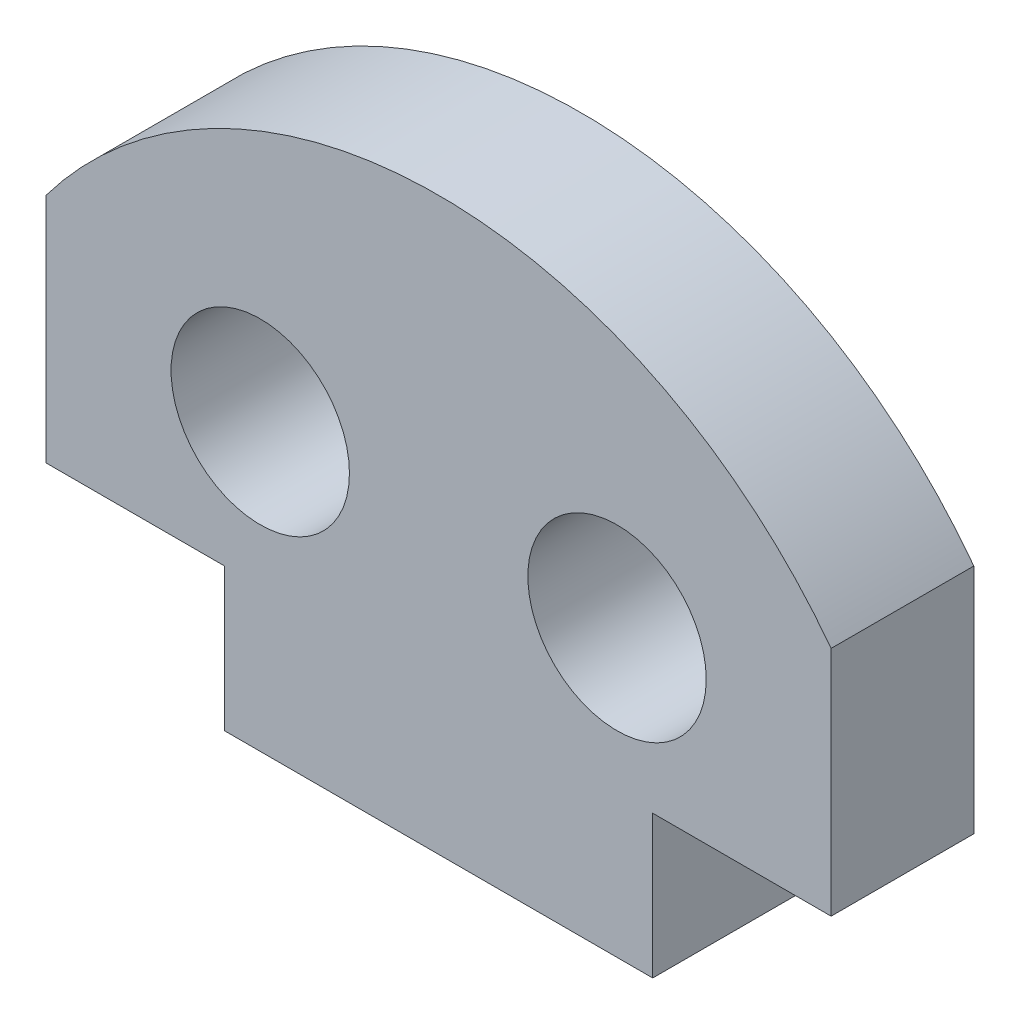
ISO-10303-21;
HEADER;
FILE_DESCRIPTION(('STEP AP214'),'2;1');
FILE_NAME('part.step','',(''),(''),'','','');
FILE_SCHEMA(('AUTOMOTIVE_DESIGN { 1 0 10303 214 1 1 1 1 }'));
ENDSEC;
DATA;
#1=APPLICATION_CONTEXT('core data for automotive mechanical design processes');
#2=APPLICATION_PROTOCOL_DEFINITION('international standard','automotive_design',2000,#1);
#3=PRODUCT_CONTEXT('',#1,'mechanical');
#4=PRODUCT('Part','Part','',(#3));
#5=PRODUCT_RELATED_PRODUCT_CATEGORY('part','',(#4));
#6=PRODUCT_DEFINITION_FORMATION('','',#4);
#7=PRODUCT_DEFINITION_CONTEXT('part definition',#1,'design');
#8=PRODUCT_DEFINITION('design','',#6,#7);
#9=PRODUCT_DEFINITION_SHAPE('','',#8);
#10=(LENGTH_UNIT() NAMED_UNIT(*) SI_UNIT(.MILLI.,.METRE.));
#11=(NAMED_UNIT(*) PLANE_ANGLE_UNIT() SI_UNIT($,.RADIAN.));
#12=(NAMED_UNIT(*) SI_UNIT($,.STERADIAN.) SOLID_ANGLE_UNIT());
#13=UNCERTAINTY_MEASURE_WITH_UNIT(LENGTH_MEASURE(1.E-05),#10,'distance_accuracy_value','');
#14=(GEOMETRIC_REPRESENTATION_CONTEXT(3) GLOBAL_UNCERTAINTY_ASSIGNED_CONTEXT((#13)) GLOBAL_UNIT_ASSIGNED_CONTEXT((#10,
#11,#12)) REPRESENTATION_CONTEXT('',''));
#15=CARTESIAN_POINT('',(0.,0.,0.));
#16=DIRECTION('',(0.,0.,1.));
#17=DIRECTION('',(1.,0.,0.));
#18=AXIS2_PLACEMENT_3D('',#15,#16,#17);
#19=CARTESIAN_POINT('',(1956.67680872112,1458.00911595094,2.));
#20=DIRECTION('',(0.,0.,1.));
#21=DIRECTION('',(1.,0.,0.));
#22=AXIS2_PLACEMENT_3D('',#19,#20,#21);
#23=PLANE('',#22);
#24=CARTESIAN_POINT('',(1959.17680872112,1460.88411595094,2.));
#25=DIRECTION('',(0.,0.,1.));
#26=DIRECTION('',(1.,0.,0.));
#27=AXIS2_PLACEMENT_3D('',#24,#25,#26);
#28=CIRCLE('',#27,1.24999999999997);
#29=CARTESIAN_POINT('',(1960.42680872112,1460.88411595094,2.));
#30=VERTEX_POINT('',#29);
#31=EDGE_CURVE('E135',#30,#30,#28,.T.);
#32=ORIENTED_EDGE('',*,*,#31,.F.);
#33=EDGE_LOOP('',(#32));
#34=FACE_BOUND('',#33,.T.);
#35=CARTESIAN_POINT('',(1956.67680872112,1458.00911595094,2.));
#36=DIRECTION('',(0.,0.,1.));
#37=DIRECTION('',(1.,0.,0.));
#38=AXIS2_PLACEMENT_3D('',#35,#36,#37);
#39=CIRCLE('',#38,6.87500000000529);
#40=CARTESIAN_POINT('',(1962.17680872112,1462.13411595095,2.));
#41=VERTEX_POINT('',#40);
#42=CARTESIAN_POINT('',(1951.17680872112,1462.13411595095,2.));
#43=VERTEX_POINT('',#42);
#44=EDGE_CURVE('E146',#41,#43,#39,.T.);
#45=ORIENTED_EDGE('',*,*,#44,.T.);
#46=DIRECTION('',(0.,-1.,0.));
#47=VECTOR('',#46,1.);
#48=CARTESIAN_POINT('',(1951.17680872112,1458.88411595094,2.));
#49=LINE('',#48,#47);
#50=CARTESIAN_POINT('',(1951.17680872112,1458.88411595094,2.));
#51=VERTEX_POINT('',#50);
#52=EDGE_CURVE('E94',#43,#51,#49,.T.);
#53=ORIENTED_EDGE('',*,*,#52,.T.);
#54=DIRECTION('',(1.,0.,0.));
#55=VECTOR('',#54,1.);
#56=CARTESIAN_POINT('',(1953.67680872112,1458.88411595094,2.));
#57=LINE('',#56,#55);
#58=CARTESIAN_POINT('',(1953.67680872112,1458.88411595094,2.));
#59=VERTEX_POINT('',#58);
#60=EDGE_CURVE('E161',#51,#59,#57,.T.);
#61=ORIENTED_EDGE('',*,*,#60,.T.);
#62=DIRECTION('',(0.,-1.,0.));
#63=VECTOR('',#62,1.);
#64=CARTESIAN_POINT('',(1953.67680872112,1458.88411595094,2.));
#65=LINE('',#64,#63);
#66=CARTESIAN_POINT('',(1953.67680872112,1456.88411595094,2.));
#67=VERTEX_POINT('',#66);
#68=EDGE_CURVE('E174',#59,#67,#65,.T.);
#69=ORIENTED_EDGE('',*,*,#68,.T.);
#70=DIRECTION('',(1.,0.,0.));
#71=VECTOR('',#70,1.);
#72=CARTESIAN_POINT('',(1953.67680872112,1456.88411595094,2.));
#73=LINE('',#72,#71);
#74=CARTESIAN_POINT('',(1959.67680872112,1456.88411595094,2.));
#75=VERTEX_POINT('',#74);
#76=EDGE_CURVE('E113',#67,#75,#73,.T.);
#77=ORIENTED_EDGE('',*,*,#76,.T.);
#78=DIRECTION('',(0.,1.,0.));
#79=VECTOR('',#78,1.);
#80=CARTESIAN_POINT('',(1959.67680872112,1456.88411595094,2.));
#81=LINE('',#80,#79);
#82=CARTESIAN_POINT('',(1959.67680872112,1458.88411595095,2.));
#83=VERTEX_POINT('',#82);
#84=EDGE_CURVE('E107',#75,#83,#81,.T.);
#85=ORIENTED_EDGE('',*,*,#84,.T.);
#86=DIRECTION('',(1.,0.,0.));
#87=VECTOR('',#86,1.);
#88=CARTESIAN_POINT('',(1962.17680872112,1458.88411595095,2.));
#89=LINE('',#88,#87);
#90=CARTESIAN_POINT('',(1962.17680872112,1458.88411595095,2.));
#91=VERTEX_POINT('',#90);
#92=EDGE_CURVE('E111',#83,#91,#89,.T.);
#93=ORIENTED_EDGE('',*,*,#92,.T.);
#94=DIRECTION('',(0.,1.,0.));
#95=VECTOR('',#94,1.);
#96=CARTESIAN_POINT('',(1962.17680872112,1458.88411595095,2.));
#97=LINE('',#96,#95);
#98=EDGE_CURVE('E51',#91,#41,#97,.T.);
#99=ORIENTED_EDGE('',*,*,#98,.T.);
#100=EDGE_LOOP('',(#45,#53,#61,#69,#77,#85,#93,#99));
#101=FACE_BOUND('',#100,.T.);
#102=CARTESIAN_POINT('',(1954.17680872112,1460.88411595095,2.));
#103=DIRECTION('',(0.,0.,1.));
#104=DIRECTION('',(1.,0.,0.));
#105=AXIS2_PLACEMENT_3D('',#102,#103,#104);
#106=CIRCLE('',#105,1.24999999999997);
#107=CARTESIAN_POINT('',(1955.42680872112,1460.88411595095,2.));
#108=VERTEX_POINT('',#107);
#109=EDGE_CURVE('E183',#108,#108,#106,.T.);
#110=ORIENTED_EDGE('',*,*,#109,.F.);
#111=EDGE_LOOP('',(#110));
#112=FACE_BOUND('',#111,.T.);
#113=ADVANCED_FACE('F34',(#34,#101,#112),#23,.T.);
#114=CARTESIAN_POINT('',(1956.67680872112,1458.00911595094,0.));
#115=DIRECTION('',(0.,0.,1.));
#116=DIRECTION('',(1.,0.,0.));
#117=AXIS2_PLACEMENT_3D('',#114,#115,#116);
#118=PLANE('',#117);
#119=CARTESIAN_POINT('',(1959.17680872112,1460.88411595094,0.));
#120=DIRECTION('',(0.,0.,1.));
#121=DIRECTION('',(1.,0.,0.));
#122=AXIS2_PLACEMENT_3D('',#119,#120,#121);
#123=CIRCLE('',#122,1.24999999999997);
#124=CARTESIAN_POINT('',(1960.42680872112,1460.88411595094,0.));
#125=VERTEX_POINT('',#124);
#126=EDGE_CURVE('E180',#125,#125,#123,.T.);
#127=ORIENTED_EDGE('',*,*,#126,.T.);
#128=EDGE_LOOP('',(#127));
#129=FACE_BOUND('',#128,.T.);
#130=CARTESIAN_POINT('',(1956.67680872112,1458.00911595094,0.));
#131=DIRECTION('',(0.,0.,1.));
#132=DIRECTION('',(1.,0.,0.));
#133=AXIS2_PLACEMENT_3D('',#130,#131,#132);
#134=CIRCLE('',#133,6.87500000000529);
#135=CARTESIAN_POINT('',(1962.17680872112,1462.13411595095,0.));
#136=VERTEX_POINT('',#135);
#137=CARTESIAN_POINT('',(1951.17680872112,1462.13411595095,0.));
#138=VERTEX_POINT('',#137);
#139=EDGE_CURVE('E131',#136,#138,#134,.T.);
#140=ORIENTED_EDGE('',*,*,#139,.F.);
#141=DIRECTION('',(0.,1.,0.));
#142=VECTOR('',#141,1.);
#143=CARTESIAN_POINT('',(1962.17680872112,1458.88411595095,0.));
#144=LINE('',#143,#142);
#145=CARTESIAN_POINT('',(1962.17680872112,1458.88411595095,0.));
#146=VERTEX_POINT('',#145);
#147=EDGE_CURVE('E86',#146,#136,#144,.T.);
#148=ORIENTED_EDGE('',*,*,#147,.F.);
#149=DIRECTION('',(1.,0.,0.));
#150=VECTOR('',#149,1.);
#151=CARTESIAN_POINT('',(1962.17680872112,1458.88411595095,0.));
#152=LINE('',#151,#150);
#153=CARTESIAN_POINT('',(1959.67680872112,1458.88411595095,0.));
#154=VERTEX_POINT('',#153);
#155=EDGE_CURVE('E80',#154,#146,#152,.T.);
#156=ORIENTED_EDGE('',*,*,#155,.F.);
#157=DIRECTION('',(0.,1.,0.));
#158=VECTOR('',#157,1.);
#159=CARTESIAN_POINT('',(1959.67680872112,1456.88411595094,0.));
#160=LINE('',#159,#158);
#161=CARTESIAN_POINT('',(1959.67680872112,1456.88411595094,0.));
#162=VERTEX_POINT('',#161);
#163=EDGE_CURVE('E121',#162,#154,#160,.T.);
#164=ORIENTED_EDGE('',*,*,#163,.F.);
#165=DIRECTION('',(1.,0.,0.));
#166=VECTOR('',#165,1.);
#167=CARTESIAN_POINT('',(1953.67680872112,1456.88411595094,0.));
#168=LINE('',#167,#166);
#169=CARTESIAN_POINT('',(1953.67680872112,1456.88411595094,0.));
#170=VERTEX_POINT('',#169);
#171=EDGE_CURVE('E141',#170,#162,#168,.T.);
#172=ORIENTED_EDGE('',*,*,#171,.F.);
#173=DIRECTION('',(0.,-1.,0.));
#174=VECTOR('',#173,1.);
#175=CARTESIAN_POINT('',(1953.67680872112,1458.88411595094,0.));
#176=LINE('',#175,#174);
#177=CARTESIAN_POINT('',(1953.67680872112,1458.88411595094,0.));
#178=VERTEX_POINT('',#177);
#179=EDGE_CURVE('E139',#178,#170,#176,.T.);
#180=ORIENTED_EDGE('',*,*,#179,.F.);
#181=DIRECTION('',(1.,0.,0.));
#182=VECTOR('',#181,1.);
#183=CARTESIAN_POINT('',(1953.67680872112,1458.88411595094,0.));
#184=LINE('',#183,#182);
#185=CARTESIAN_POINT('',(1951.17680872112,1458.88411595094,0.));
#186=VERTEX_POINT('',#185);
#187=EDGE_CURVE('E137',#186,#178,#184,.T.);
#188=ORIENTED_EDGE('',*,*,#187,.F.);
#189=DIRECTION('',(0.,-1.,0.));
#190=VECTOR('',#189,1.);
#191=CARTESIAN_POINT('',(1951.17680872112,1458.88411595094,0.));
#192=LINE('',#191,#190);
#193=EDGE_CURVE('E134',#138,#186,#192,.T.);
#194=ORIENTED_EDGE('',*,*,#193,.F.);
#195=EDGE_LOOP('',(#140,#148,#156,#164,#172,#180,#188,#194));
#196=FACE_BOUND('',#195,.T.);
#197=CARTESIAN_POINT('',(1954.17680872112,1460.88411595095,0.));
#198=DIRECTION('',(0.,0.,1.));
#199=DIRECTION('',(1.,0.,0.));
#200=AXIS2_PLACEMENT_3D('',#197,#198,#199);
#201=CIRCLE('',#200,1.24999999999997);
#202=CARTESIAN_POINT('',(1955.42680872112,1460.88411595095,0.));
#203=VERTEX_POINT('',#202);
#204=EDGE_CURVE('E186',#203,#203,#201,.T.);
#205=ORIENTED_EDGE('',*,*,#204,.T.);
#206=EDGE_LOOP('',(#205));
#207=FACE_BOUND('',#206,.T.);
#208=ADVANCED_FACE('F165',(#129,#196,#207),#118,.F.);
#209=CARTESIAN_POINT('',(1956.67680872112,1458.00911595094,2.));
#210=DIRECTION('',(0.,0.,-1.));
#211=DIRECTION('',(-1.,0.,0.));
#212=AXIS2_PLACEMENT_3D('',#209,#210,#211);
#213=CYLINDRICAL_SURFACE('',#212,6.87500000000529);
#214=ORIENTED_EDGE('',*,*,#139,.T.);
#215=DIRECTION('',(0.,0.,-1.));
#216=VECTOR('',#215,1.);
#217=CARTESIAN_POINT('',(1951.17680872112,1462.13411595095,2.));
#218=LINE('',#217,#216);
#219=EDGE_CURVE('E11',#43,#138,#218,.T.);
#220=ORIENTED_EDGE('',*,*,#219,.F.);
#221=ORIENTED_EDGE('',*,*,#44,.F.);
#222=DIRECTION('',(0.,0.,-1.));
#223=VECTOR('',#222,1.);
#224=CARTESIAN_POINT('',(1962.17680872112,1462.13411595095,2.));
#225=LINE('',#224,#223);
#226=EDGE_CURVE('E127',#41,#136,#225,.T.);
#227=ORIENTED_EDGE('',*,*,#226,.T.);
#228=EDGE_LOOP('',(#214,#220,#221,#227));
#229=FACE_BOUND('',#228,.T.);
#230=ADVANCED_FACE('F36',(#229),#213,.T.);
#231=CARTESIAN_POINT('',(1951.17680872112,1458.88411595094,2.));
#232=DIRECTION('',(1.,0.,0.));
#233=DIRECTION('',(0.,0.,-1.));
#234=AXIS2_PLACEMENT_3D('',#231,#232,#233);
#235=PLANE('',#234);
#236=ORIENTED_EDGE('',*,*,#193,.T.);
#237=DIRECTION('',(0.,0.,-1.));
#238=VECTOR('',#237,1.);
#239=CARTESIAN_POINT('',(1951.17680872112,1458.88411595094,2.));
#240=LINE('',#239,#238);
#241=EDGE_CURVE('E43',#51,#186,#240,.T.);
#242=ORIENTED_EDGE('',*,*,#241,.F.);
#243=ORIENTED_EDGE('',*,*,#52,.F.);
#244=ORIENTED_EDGE('',*,*,#219,.T.);
#245=EDGE_LOOP('',(#236,#242,#243,#244));
#246=FACE_BOUND('',#245,.T.);
#247=ADVANCED_FACE('F219',(#246),#235,.F.);
#248=CARTESIAN_POINT('',(1953.67680872112,1458.88411595094,2.));
#249=DIRECTION('',(0.,1.,0.));
#250=DIRECTION('',(0.,0.,1.));
#251=AXIS2_PLACEMENT_3D('',#248,#249,#250);
#252=PLANE('',#251);
#253=ORIENTED_EDGE('',*,*,#187,.T.);
#254=DIRECTION('',(0.,0.,-1.));
#255=VECTOR('',#254,1.);
#256=CARTESIAN_POINT('',(1953.67680872112,1458.88411595094,2.));
#257=LINE('',#256,#255);
#258=EDGE_CURVE('E153',#59,#178,#257,.T.);
#259=ORIENTED_EDGE('',*,*,#258,.F.);
#260=ORIENTED_EDGE('',*,*,#60,.F.);
#261=ORIENTED_EDGE('',*,*,#241,.T.);
#262=EDGE_LOOP('',(#253,#259,#260,#261));
#263=FACE_BOUND('',#262,.T.);
#264=ADVANCED_FACE('F159',(#263),#252,.F.);
#265=CARTESIAN_POINT('',(1953.67680872112,1458.88411595094,2.));
#266=DIRECTION('',(1.,0.,0.));
#267=DIRECTION('',(0.,0.,-1.));
#268=AXIS2_PLACEMENT_3D('',#265,#266,#267);
#269=PLANE('',#268);
#270=ORIENTED_EDGE('',*,*,#179,.T.);
#271=DIRECTION('',(0.,0.,-1.));
#272=VECTOR('',#271,1.);
#273=CARTESIAN_POINT('',(1953.67680872112,1456.88411595094,2.));
#274=LINE('',#273,#272);
#275=EDGE_CURVE('E150',#67,#170,#274,.T.);
#276=ORIENTED_EDGE('',*,*,#275,.F.);
#277=ORIENTED_EDGE('',*,*,#68,.F.);
#278=ORIENTED_EDGE('',*,*,#258,.T.);
#279=EDGE_LOOP('',(#270,#276,#277,#278));
#280=FACE_BOUND('',#279,.T.);
#281=ADVANCED_FACE('F170',(#280),#269,.F.);
#282=CARTESIAN_POINT('',(1953.67680872112,1456.88411595094,2.));
#283=DIRECTION('',(0.,1.,0.));
#284=DIRECTION('',(0.,0.,1.));
#285=AXIS2_PLACEMENT_3D('',#282,#283,#284);
#286=PLANE('',#285);
#287=ORIENTED_EDGE('',*,*,#171,.T.);
#288=DIRECTION('',(0.,0.,-1.));
#289=VECTOR('',#288,1.);
#290=CARTESIAN_POINT('',(1959.67680872112,1456.88411595094,2.));
#291=LINE('',#290,#289);
#292=EDGE_CURVE('E122',#75,#162,#291,.T.);
#293=ORIENTED_EDGE('',*,*,#292,.F.);
#294=ORIENTED_EDGE('',*,*,#76,.F.);
#295=ORIENTED_EDGE('',*,*,#275,.T.);
#296=EDGE_LOOP('',(#287,#293,#294,#295));
#297=FACE_BOUND('',#296,.T.);
#298=ADVANCED_FACE('F173',(#297),#286,.F.);
#299=CARTESIAN_POINT('',(1959.67680872112,1456.88411595094,2.));
#300=DIRECTION('',(-1.,0.,0.));
#301=DIRECTION('',(0.,0.,1.));
#302=AXIS2_PLACEMENT_3D('',#299,#300,#301);
#303=PLANE('',#302);
#304=ORIENTED_EDGE('',*,*,#163,.T.);
#305=DIRECTION('',(0.,0.,-1.));
#306=VECTOR('',#305,1.);
#307=CARTESIAN_POINT('',(1959.67680872112,1458.88411595095,2.));
#308=LINE('',#307,#306);
#309=EDGE_CURVE('E118',#83,#154,#308,.T.);
#310=ORIENTED_EDGE('',*,*,#309,.F.);
#311=ORIENTED_EDGE('',*,*,#84,.F.);
#312=ORIENTED_EDGE('',*,*,#292,.T.);
#313=EDGE_LOOP('',(#304,#310,#311,#312));
#314=FACE_BOUND('',#313,.T.);
#315=ADVANCED_FACE('F119',(#314),#303,.F.);
#316=CARTESIAN_POINT('',(1962.17680872112,1458.88411595095,2.));
#317=DIRECTION('',(0.,1.,0.));
#318=DIRECTION('',(0.,0.,1.));
#319=AXIS2_PLACEMENT_3D('',#316,#317,#318);
#320=PLANE('',#319);
#321=ORIENTED_EDGE('',*,*,#155,.T.);
#322=DIRECTION('',(0.,0.,-1.));
#323=VECTOR('',#322,1.);
#324=CARTESIAN_POINT('',(1962.17680872112,1458.88411595095,2.));
#325=LINE('',#324,#323);
#326=EDGE_CURVE('E123',#91,#146,#325,.T.);
#327=ORIENTED_EDGE('',*,*,#326,.F.);
#328=ORIENTED_EDGE('',*,*,#92,.F.);
#329=ORIENTED_EDGE('',*,*,#309,.T.);
#330=EDGE_LOOP('',(#321,#327,#328,#329));
#331=FACE_BOUND('',#330,.T.);
#332=ADVANCED_FACE('F125',(#331),#320,.F.);
#333=CARTESIAN_POINT('',(1962.17680872112,1458.88411595095,2.));
#334=DIRECTION('',(-1.,0.,0.));
#335=DIRECTION('',(0.,0.,1.));
#336=AXIS2_PLACEMENT_3D('',#333,#334,#335);
#337=PLANE('',#336);
#338=ORIENTED_EDGE('',*,*,#147,.T.);
#339=ORIENTED_EDGE('',*,*,#226,.F.);
#340=ORIENTED_EDGE('',*,*,#98,.F.);
#341=ORIENTED_EDGE('',*,*,#326,.T.);
#342=EDGE_LOOP('',(#338,#339,#340,#341));
#343=FACE_BOUND('',#342,.T.);
#344=ADVANCED_FACE('F207',(#343),#337,.F.);
#345=CARTESIAN_POINT('',(1959.17680872112,1460.88411595094,2.));
#346=DIRECTION('',(0.,0.,-1.));
#347=DIRECTION('',(-1.,0.,0.));
#348=AXIS2_PLACEMENT_3D('',#345,#346,#347);
#349=CYLINDRICAL_SURFACE('',#348,1.24999999999997);
#350=ORIENTED_EDGE('',*,*,#31,.T.);
#351=EDGE_LOOP('',(#350));
#352=FACE_BOUND('',#351,.T.);
#353=ORIENTED_EDGE('',*,*,#126,.F.);
#354=EDGE_LOOP('',(#353));
#355=FACE_BOUND('',#354,.T.);
#356=ADVANCED_FACE('F204',(#352,#355),#349,.F.);
#357=CARTESIAN_POINT('',(1954.17680872112,1460.88411595095,2.));
#358=DIRECTION('',(0.,0.,-1.));
#359=DIRECTION('',(-1.,0.,0.));
#360=AXIS2_PLACEMENT_3D('',#357,#358,#359);
#361=CYLINDRICAL_SURFACE('',#360,1.24999999999997);
#362=ORIENTED_EDGE('',*,*,#109,.T.);
#363=EDGE_LOOP('',(#362));
#364=FACE_BOUND('',#363,.T.);
#365=ORIENTED_EDGE('',*,*,#204,.F.);
#366=EDGE_LOOP('',(#365));
#367=FACE_BOUND('',#366,.T.);
#368=ADVANCED_FACE('F192',(#364,#367),#361,.F.);
#369=CLOSED_SHELL('',(#113,#208,#230,#247,#264,#281,#298,#315,#332,#344,#356,#368));
#370=MANIFOLD_SOLID_BREP('B2',#369);
#371=ADVANCED_BREP_SHAPE_REPRESENTATION('',(#18,#370),#14);
#372=SHAPE_DEFINITION_REPRESENTATION(#9,#371);
ENDSEC;
END-ISO-10303-21;
